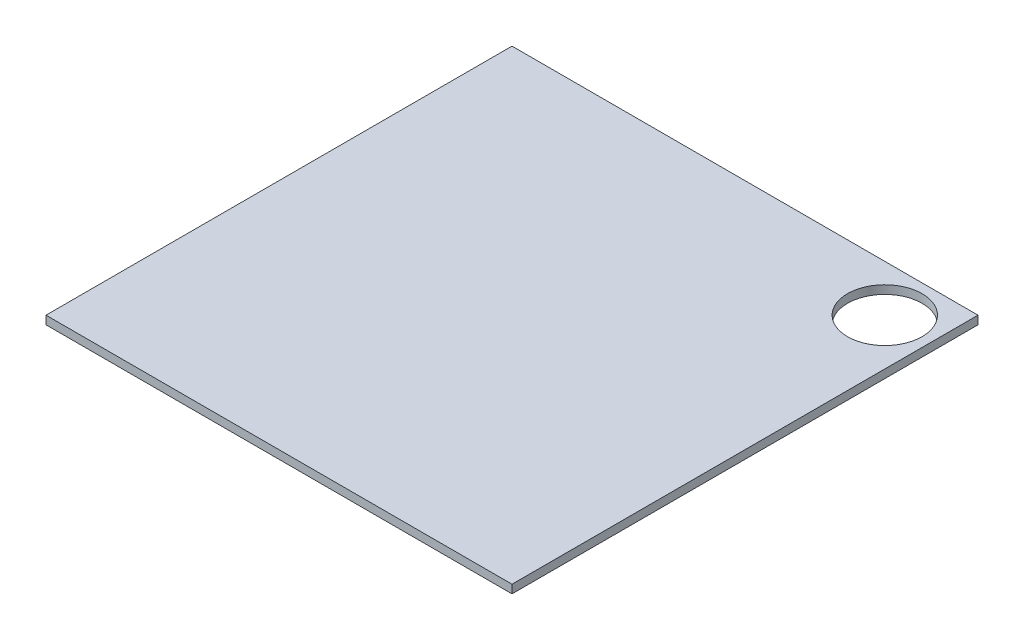
ISO-10303-21;
HEADER;
FILE_DESCRIPTION(('STEP AP214'),'2;1');
FILE_NAME('part.step','',(''),(''),'','','');
FILE_SCHEMA(('AUTOMOTIVE_DESIGN { 1 0 10303 214 1 1 1 1 }'));
ENDSEC;
DATA;
#1=APPLICATION_CONTEXT('core data for automotive mechanical design processes');
#2=APPLICATION_PROTOCOL_DEFINITION('international standard','automotive_design',2000,#1);
#3=PRODUCT_CONTEXT('',#1,'mechanical');
#4=PRODUCT('Part','Part','',(#3));
#5=PRODUCT_RELATED_PRODUCT_CATEGORY('part','',(#4));
#6=PRODUCT_DEFINITION_FORMATION('','',#4);
#7=PRODUCT_DEFINITION_CONTEXT('part definition',#1,'design');
#8=PRODUCT_DEFINITION('design','',#6,#7);
#9=PRODUCT_DEFINITION_SHAPE('','',#8);
#10=(LENGTH_UNIT() NAMED_UNIT(*) SI_UNIT(.MILLI.,.METRE.));
#11=(NAMED_UNIT(*) PLANE_ANGLE_UNIT() SI_UNIT($,.RADIAN.));
#12=(NAMED_UNIT(*) SI_UNIT($,.STERADIAN.) SOLID_ANGLE_UNIT());
#13=UNCERTAINTY_MEASURE_WITH_UNIT(LENGTH_MEASURE(1.E-05),#10,'distance_accuracy_value','');
#14=(GEOMETRIC_REPRESENTATION_CONTEXT(3) GLOBAL_UNCERTAINTY_ASSIGNED_CONTEXT((#13)) GLOBAL_UNIT_ASSIGNED_CONTEXT((#10,
#11,#12)) REPRESENTATION_CONTEXT('',''));
#15=CARTESIAN_POINT('',(0.,0.,0.));
#16=DIRECTION('',(0.,0.,1.));
#17=DIRECTION('',(1.,0.,0.));
#18=AXIS2_PLACEMENT_3D('',#15,#16,#17);
#19=CARTESIAN_POINT('',(0.,1.8,0.));
#20=DIRECTION('',(1.,0.,0.));
#21=DIRECTION('',(0.,0.,-1.));
#22=AXIS2_PLACEMENT_3D('',#19,#20,#21);
#23=PLANE('',#22);
#24=DIRECTION('',(0.,0.,1.));
#25=VECTOR('',#24,1.);
#26=CARTESIAN_POINT('',(0.,0.,0.));
#27=LINE('',#26,#25);
#28=CARTESIAN_POINT('',(0.,0.,-100.));
#29=VERTEX_POINT('',#28);
#30=CARTESIAN_POINT('',(0.,0.,0.));
#31=VERTEX_POINT('',#30);
#32=EDGE_CURVE('E98',#29,#31,#27,.T.);
#33=ORIENTED_EDGE('',*,*,#32,.T.);
#34=DIRECTION('',(0.,-1.,0.));
#35=VECTOR('',#34,1.);
#36=CARTESIAN_POINT('',(0.,1.8,0.));
#37=LINE('',#36,#35);
#38=CARTESIAN_POINT('',(0.,1.8,0.));
#39=VERTEX_POINT('',#38);
#40=EDGE_CURVE('E11',#39,#31,#37,.T.);
#41=ORIENTED_EDGE('',*,*,#40,.F.);
#42=DIRECTION('',(0.,0.,1.));
#43=VECTOR('',#42,1.);
#44=CARTESIAN_POINT('',(0.,1.8,0.));
#45=LINE('',#44,#43);
#46=CARTESIAN_POINT('',(0.,1.8,-100.));
#47=VERTEX_POINT('',#46);
#48=EDGE_CURVE('E86',#47,#39,#45,.T.);
#49=ORIENTED_EDGE('',*,*,#48,.F.);
#50=DIRECTION('',(0.,-1.,0.));
#51=VECTOR('',#50,1.);
#52=CARTESIAN_POINT('',(0.,1.8,-100.));
#53=LINE('',#52,#51);
#54=EDGE_CURVE('E94',#47,#29,#53,.T.);
#55=ORIENTED_EDGE('',*,*,#54,.T.);
#56=EDGE_LOOP('',(#33,#41,#49,#55));
#57=FACE_BOUND('',#56,.T.);
#58=ADVANCED_FACE('F35',(#57),#23,.F.);
#59=CARTESIAN_POINT('',(0.,1.8,0.));
#60=DIRECTION('',(0.,0.,-1.));
#61=DIRECTION('',(-1.,0.,0.));
#62=AXIS2_PLACEMENT_3D('',#59,#60,#61);
#63=PLANE('',#62);
#64=DIRECTION('',(1.,0.,0.));
#65=VECTOR('',#64,1.);
#66=CARTESIAN_POINT('',(0.,0.,0.));
#67=LINE('',#66,#65);
#68=CARTESIAN_POINT('',(100.,0.,0.));
#69=VERTEX_POINT('',#68);
#70=EDGE_CURVE('E90',#31,#69,#67,.T.);
#71=ORIENTED_EDGE('',*,*,#70,.T.);
#72=DIRECTION('',(0.,-1.,0.));
#73=VECTOR('',#72,1.);
#74=CARTESIAN_POINT('',(100.,1.8,0.));
#75=LINE('',#74,#73);
#76=CARTESIAN_POINT('',(100.,1.8,0.));
#77=VERTEX_POINT('',#76);
#78=EDGE_CURVE('E43',#77,#69,#75,.T.);
#79=ORIENTED_EDGE('',*,*,#78,.F.);
#80=DIRECTION('',(1.,0.,0.));
#81=VECTOR('',#80,1.);
#82=CARTESIAN_POINT('',(0.,1.8,0.));
#83=LINE('',#82,#81);
#84=EDGE_CURVE('E81',#39,#77,#83,.T.);
#85=ORIENTED_EDGE('',*,*,#84,.F.);
#86=ORIENTED_EDGE('',*,*,#40,.T.);
#87=EDGE_LOOP('',(#71,#79,#85,#86));
#88=FACE_BOUND('',#87,.T.);
#89=ADVANCED_FACE('F89',(#88),#63,.F.);
#90=CARTESIAN_POINT('',(100.,1.8,0.));
#91=DIRECTION('',(-1.,0.,0.));
#92=DIRECTION('',(0.,0.,1.));
#93=AXIS2_PLACEMENT_3D('',#90,#91,#92);
#94=PLANE('',#93);
#95=DIRECTION('',(0.,0.,-1.));
#96=VECTOR('',#95,1.);
#97=CARTESIAN_POINT('',(100.,0.,0.));
#98=LINE('',#97,#96);
#99=CARTESIAN_POINT('',(100.,0.,-100.));
#100=VERTEX_POINT('',#99);
#101=EDGE_CURVE('E68',#69,#100,#98,.T.);
#102=ORIENTED_EDGE('',*,*,#101,.T.);
#103=DIRECTION('',(0.,-1.,0.));
#104=VECTOR('',#103,1.);
#105=CARTESIAN_POINT('',(100.,1.8,-100.));
#106=LINE('',#105,#104);
#107=CARTESIAN_POINT('',(100.,1.8,-100.));
#108=VERTEX_POINT('',#107);
#109=EDGE_CURVE('E91',#108,#100,#106,.T.);
#110=ORIENTED_EDGE('',*,*,#109,.F.);
#111=DIRECTION('',(0.,0.,-1.));
#112=VECTOR('',#111,1.);
#113=CARTESIAN_POINT('',(100.,1.8,0.));
#114=LINE('',#113,#112);
#115=EDGE_CURVE('E84',#77,#108,#114,.T.);
#116=ORIENTED_EDGE('',*,*,#115,.F.);
#117=ORIENTED_EDGE('',*,*,#78,.T.);
#118=EDGE_LOOP('',(#102,#110,#116,#117));
#119=FACE_BOUND('',#118,.T.);
#120=ADVANCED_FACE('F92',(#119),#94,.F.);
#121=CARTESIAN_POINT('',(0.,1.8,-100.));
#122=DIRECTION('',(0.,0.,1.));
#123=DIRECTION('',(1.,0.,0.));
#124=AXIS2_PLACEMENT_3D('',#121,#122,#123);
#125=PLANE('',#124);
#126=DIRECTION('',(-1.,0.,0.));
#127=VECTOR('',#126,1.);
#128=CARTESIAN_POINT('',(0.,0.,-100.));
#129=LINE('',#128,#127);
#130=EDGE_CURVE('E74',#100,#29,#129,.T.);
#131=ORIENTED_EDGE('',*,*,#130,.T.);
#132=ORIENTED_EDGE('',*,*,#54,.F.);
#133=DIRECTION('',(-1.,0.,0.));
#134=VECTOR('',#133,1.);
#135=CARTESIAN_POINT('',(0.,1.8,-100.));
#136=LINE('',#135,#134);
#137=EDGE_CURVE('E51',#108,#47,#136,.T.);
#138=ORIENTED_EDGE('',*,*,#137,.F.);
#139=ORIENTED_EDGE('',*,*,#109,.T.);
#140=EDGE_LOOP('',(#131,#132,#138,#139));
#141=FACE_BOUND('',#140,.T.);
#142=ADVANCED_FACE('F106',(#141),#125,.F.);
#143=CARTESIAN_POINT('',(0.,1.8,0.));
#144=DIRECTION('',(0.,-1.,0.));
#145=DIRECTION('',(0.,0.,-1.));
#146=AXIS2_PLACEMENT_3D('',#143,#144,#145);
#147=PLANE('',#146);
#148=CARTESIAN_POINT('',(90.,1.8,-90.));
#149=DIRECTION('',(0.,1.,0.));
#150=DIRECTION('',(0.,0.,1.));
#151=AXIS2_PLACEMENT_3D('',#148,#149,#150);
#152=CIRCLE('',#151,8.00000000000001);
#153=CARTESIAN_POINT('',(90.,1.8,-82.));
#154=VERTEX_POINT('',#153);
#155=EDGE_CURVE('E112',#154,#154,#152,.T.);
#156=ORIENTED_EDGE('',*,*,#155,.F.);
#157=EDGE_LOOP('',(#156));
#158=FACE_BOUND('',#157,.T.);
#159=ORIENTED_EDGE('',*,*,#48,.T.);
#160=ORIENTED_EDGE('',*,*,#84,.T.);
#161=ORIENTED_EDGE('',*,*,#115,.T.);
#162=ORIENTED_EDGE('',*,*,#137,.T.);
#163=EDGE_LOOP('',(#159,#160,#161,#162));
#164=FACE_BOUND('',#163,.T.);
#165=ADVANCED_FACE('F82',(#158,#164),#147,.F.);
#166=CARTESIAN_POINT('',(0.,0.,0.));
#167=DIRECTION('',(0.,-1.,0.));
#168=DIRECTION('',(0.,0.,-1.));
#169=AXIS2_PLACEMENT_3D('',#166,#167,#168);
#170=PLANE('',#169);
#171=CARTESIAN_POINT('',(90.,0.,-90.));
#172=DIRECTION('',(0.,1.,0.));
#173=DIRECTION('',(0.,0.,1.));
#174=AXIS2_PLACEMENT_3D('',#171,#172,#173);
#175=CIRCLE('',#174,8.00000000000001);
#176=CARTESIAN_POINT('',(90.,0.,-82.));
#177=VERTEX_POINT('',#176);
#178=EDGE_CURVE('E101',#177,#177,#175,.T.);
#179=ORIENTED_EDGE('',*,*,#178,.T.);
#180=EDGE_LOOP('',(#179));
#181=FACE_BOUND('',#180,.T.);
#182=ORIENTED_EDGE('',*,*,#32,.F.);
#183=ORIENTED_EDGE('',*,*,#130,.F.);
#184=ORIENTED_EDGE('',*,*,#101,.F.);
#185=ORIENTED_EDGE('',*,*,#70,.F.);
#186=EDGE_LOOP('',(#182,#183,#184,#185));
#187=FACE_BOUND('',#186,.T.);
#188=ADVANCED_FACE('F109',(#181,#187),#170,.T.);
#189=CARTESIAN_POINT('',(90.,0.,-90.));
#190=DIRECTION('',(0.,1.,0.));
#191=DIRECTION('',(0.,0.,1.));
#192=AXIS2_PLACEMENT_3D('',#189,#190,#191);
#193=CYLINDRICAL_SURFACE('',#192,8.00000000000001);
#194=ORIENTED_EDGE('',*,*,#178,.F.);
#195=EDGE_LOOP('',(#194));
#196=FACE_BOUND('',#195,.T.);
#197=ORIENTED_EDGE('',*,*,#155,.T.);
#198=EDGE_LOOP('',(#197));
#199=FACE_BOUND('',#198,.T.);
#200=ADVANCED_FACE('F119',(#196,#199),#193,.F.);
#201=CLOSED_SHELL('',(#58,#89,#120,#142,#165,#188,#200));
#202=MANIFOLD_SOLID_BREP('B2',#201);
#203=ADVANCED_BREP_SHAPE_REPRESENTATION('',(#18,#202),#14);
#204=SHAPE_DEFINITION_REPRESENTATION(#9,#203);
ENDSEC;
END-ISO-10303-21;
